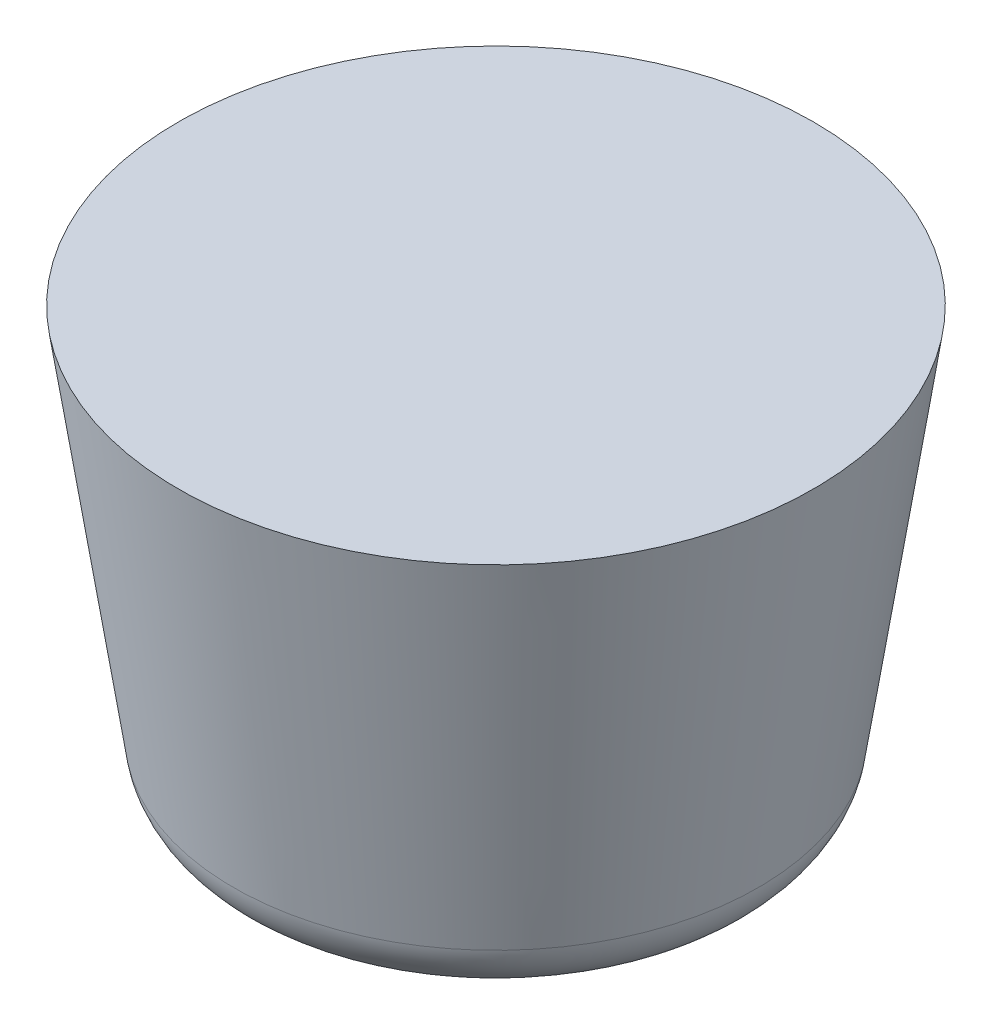
ISO-10303-21;
HEADER;
FILE_DESCRIPTION(('STEP AP214'),'2;1');
FILE_NAME('part.step','',(''),(''),'','','');
FILE_SCHEMA(('AUTOMOTIVE_DESIGN { 1 0 10303 214 1 1 1 1 }'));
ENDSEC;
DATA;
#1=APPLICATION_CONTEXT('core data for automotive mechanical design processes');
#2=APPLICATION_PROTOCOL_DEFINITION('international standard','automotive_design',2000,#1);
#3=PRODUCT_CONTEXT('',#1,'mechanical');
#4=PRODUCT('Part','Part','',(#3));
#5=PRODUCT_RELATED_PRODUCT_CATEGORY('part','',(#4));
#6=PRODUCT_DEFINITION_FORMATION('','',#4);
#7=PRODUCT_DEFINITION_CONTEXT('part definition',#1,'design');
#8=PRODUCT_DEFINITION('design','',#6,#7);
#9=PRODUCT_DEFINITION_SHAPE('','',#8);
#10=(LENGTH_UNIT() NAMED_UNIT(*) SI_UNIT(.MILLI.,.METRE.));
#11=(NAMED_UNIT(*) PLANE_ANGLE_UNIT() SI_UNIT($,.RADIAN.));
#12=(NAMED_UNIT(*) SI_UNIT($,.STERADIAN.) SOLID_ANGLE_UNIT());
#13=UNCERTAINTY_MEASURE_WITH_UNIT(LENGTH_MEASURE(1.E-05),#10,'distance_accuracy_value','');
#14=(GEOMETRIC_REPRESENTATION_CONTEXT(3) GLOBAL_UNCERTAINTY_ASSIGNED_CONTEXT((#13)) GLOBAL_UNIT_ASSIGNED_CONTEXT((#10,
#11,#12)) REPRESENTATION_CONTEXT('',''));
#15=CARTESIAN_POINT('',(0.,0.,0.));
#16=DIRECTION('',(0.,0.,1.));
#17=DIRECTION('',(1.,0.,0.));
#18=AXIS2_PLACEMENT_3D('',#15,#16,#17);
#19=CARTESIAN_POINT('',(0.,20.,0.));
#20=DIRECTION('',(0.,1.,0.));
#21=DIRECTION('',(0.,0.,1.));
#22=AXIS2_PLACEMENT_3D('',#19,#20,#21);
#23=PLANE('',#22);
#24=CARTESIAN_POINT('',(0.,20.,0.));
#25=DIRECTION('',(0.,-1.,0.));
#26=DIRECTION('',(0.,0.,-1.));
#27=AXIS2_PLACEMENT_3D('',#24,#25,#26);
#28=CIRCLE('',#27,15.);
#29=CARTESIAN_POINT('',(0.,20.,-15.));
#30=VERTEX_POINT('',#29);
#31=EDGE_CURVE('E62',#30,#30,#28,.T.);
#32=ORIENTED_EDGE('',*,*,#31,.F.);
#33=EDGE_LOOP('',(#32));
#34=FACE_BOUND('',#33,.T.);
#35=ADVANCED_FACE('F33',(#34),#23,.T.);
#36=CARTESIAN_POINT('',(0.,-0.213469358207021,0.));
#37=DIRECTION('',(0.,1.,0.));
#38=DIRECTION('',(0.,0.,1.));
#39=AXIS2_PLACEMENT_3D('',#36,#37,#38);
#40=CONICAL_SURFACE('',#39,12.,0.147340334737343);
#41=CARTESIAN_POINT('',(0.,2.39249074653107,0.));
#42=DIRECTION('',(0.,-1.,0.));
#43=DIRECTION('',(0.,0.,-1.));
#44=AXIS2_PLACEMENT_3D('',#41,#42,#43);
#45=CIRCLE('',#44,12.3867658824753);
#46=CARTESIAN_POINT('',(0.,2.39249074653107,-12.3867658824753));
#47=VERTEX_POINT('',#46);
#48=EDGE_CURVE('E11',#47,#47,#45,.F.);
#49=ORIENTED_EDGE('',*,*,#48,.T.);
#50=EDGE_LOOP('',(#49));
#51=FACE_BOUND('',#50,.T.);
#52=ORIENTED_EDGE('',*,*,#31,.T.);
#53=EDGE_LOOP('',(#52));
#54=FACE_BOUND('',#53,.T.);
#55=ADVANCED_FACE('F45',(#51,#54),#40,.T.);
#56=CARTESIAN_POINT('',(0.,0.,0.));
#57=DIRECTION('',(0.,-1.,0.));
#58=DIRECTION('',(0.,0.,-1.));
#59=AXIS2_PLACEMENT_3D('',#56,#57,#58);
#60=CONICAL_SURFACE('',#59,0.,1.55300908972483);
#61=CARTESIAN_POINT('',(0.,-0.166611266467975,0.));
#62=DIRECTION('',(0.,1.,0.));
#63=DIRECTION('',(0.,0.,1.));
#64=AXIS2_PLACEMENT_3D('',#61,#62,#63);
#65=CIRCLE('',#64,9.36591187797903);
#66=CARTESIAN_POINT('',(0.,-0.166611266467975,9.36591187797903));
#67=VERTEX_POINT('',#66);
#68=EDGE_CURVE('E40',#67,#67,#65,.F.);
#69=ORIENTED_EDGE('',*,*,#68,.T.);
#70=EDGE_LOOP('',(#69));
#71=FACE_BOUND('',#70,.T.);
#72=CARTESIAN_POINT('',(0.,0.,0.));
#73=VERTEX_POINT('',#72);
#74=VERTEX_LOOP('',#73);
#75=FACE_BOUND('',#74,.T.);
#76=ADVANCED_FACE('F43',(#71,#75),#60,.F.);
#77=CARTESIAN_POINT('',(0.,2.83291416734051,0.));
#78=DIRECTION('',(0.,1.,0.));
#79=DIRECTION('',(0.,0.,1.));
#80=AXIS2_PLACEMENT_3D('',#77,#78,#79);
#81=TOROIDAL_SURFACE('',#80,9.41927077541909,3.);
#82=ORIENTED_EDGE('',*,*,#48,.F.);
#83=EDGE_LOOP('',(#82));
#84=FACE_BOUND('',#83,.T.);
#85=ORIENTED_EDGE('',*,*,#68,.F.);
#86=EDGE_LOOP('',(#85));
#87=FACE_BOUND('',#86,.T.);
#88=ADVANCED_FACE('F35',(#84,#87),#81,.T.);
#89=CLOSED_SHELL('',(#35,#55,#76,#88));
#90=MANIFOLD_SOLID_BREP('B2',#89);
#91=ADVANCED_BREP_SHAPE_REPRESENTATION('',(#18,#90),#14);
#92=SHAPE_DEFINITION_REPRESENTATION(#9,#91);
ENDSEC;
END-ISO-10303-21;
